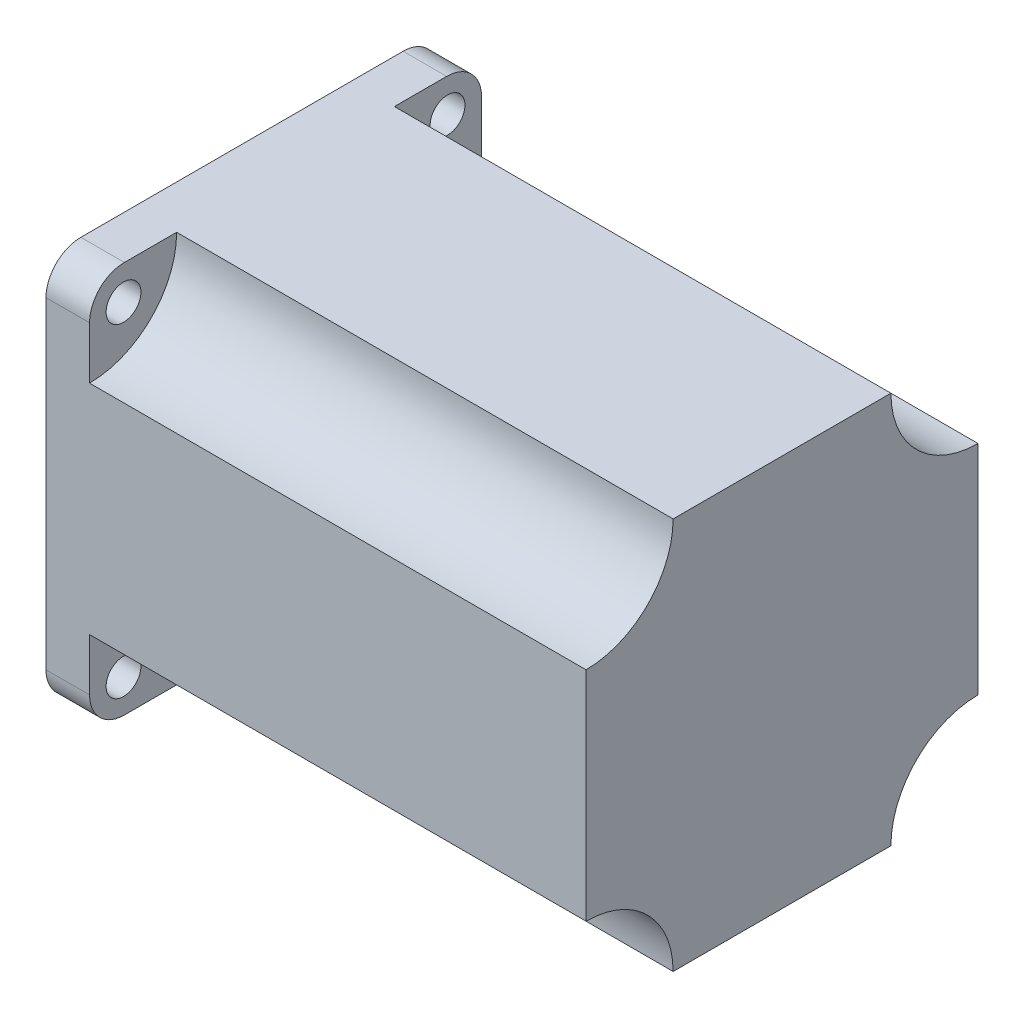
ISO-10303-21;
HEADER;
FILE_DESCRIPTION(('STEP AP214'),'2;1');
FILE_NAME('part.step','',(''),(''),'','','');
FILE_SCHEMA(('AUTOMOTIVE_DESIGN { 1 0 10303 214 1 1 1 1 }'));
ENDSEC;
DATA;
#1=APPLICATION_CONTEXT('core data for automotive mechanical design processes');
#2=APPLICATION_PROTOCOL_DEFINITION('international standard','automotive_design',2000,#1);
#3=PRODUCT_CONTEXT('',#1,'mechanical');
#4=PRODUCT('Part','Part','',(#3));
#5=PRODUCT_RELATED_PRODUCT_CATEGORY('part','',(#4));
#6=PRODUCT_DEFINITION_FORMATION('','',#4);
#7=PRODUCT_DEFINITION_CONTEXT('part definition',#1,'design');
#8=PRODUCT_DEFINITION('design','',#6,#7);
#9=PRODUCT_DEFINITION_SHAPE('','',#8);
#10=(LENGTH_UNIT() NAMED_UNIT(*) SI_UNIT(.MILLI.,.METRE.));
#11=(NAMED_UNIT(*) PLANE_ANGLE_UNIT() SI_UNIT($,.RADIAN.));
#12=(NAMED_UNIT(*) SI_UNIT($,.STERADIAN.) SOLID_ANGLE_UNIT());
#13=UNCERTAINTY_MEASURE_WITH_UNIT(LENGTH_MEASURE(1.E-05),#10,'distance_accuracy_value','');
#14=(GEOMETRIC_REPRESENTATION_CONTEXT(3) GLOBAL_UNCERTAINTY_ASSIGNED_CONTEXT((#13)) GLOBAL_UNIT_ASSIGNED_CONTEXT((#10,
#11,#12)) REPRESENTATION_CONTEXT('',''));
#15=CARTESIAN_POINT('',(0.,0.,0.));
#16=DIRECTION('',(0.,0.,1.));
#17=DIRECTION('',(1.,0.,0.));
#18=AXIS2_PLACEMENT_3D('',#15,#16,#17);
#19=CARTESIAN_POINT('',(6.35,0.,0.));
#20=DIRECTION('',(-1.,0.,0.));
#21=DIRECTION('',(0.,0.,1.));
#22=AXIS2_PLACEMENT_3D('',#19,#20,#21);
#23=PLANE('',#22);
#24=CARTESIAN_POINT('',(6.35,23.622,23.622));
#25=DIRECTION('',(1.,0.,0.));
#26=DIRECTION('',(0.,0.,-1.));
#27=AXIS2_PLACEMENT_3D('',#24,#25,#26);
#28=CIRCLE('',#27,2.54);
#29=CARTESIAN_POINT('',(6.35,23.622,21.082));
#30=VERTEX_POINT('',#29);
#31=EDGE_CURVE('E467',#30,#30,#28,.T.);
#32=ORIENTED_EDGE('',*,*,#31,.F.);
#33=EDGE_LOOP('',(#32));
#34=FACE_BOUND('',#33,.T.);
#35=DIRECTION('',(0.,-1.,0.));
#36=VECTOR('',#35,1.);
#37=CARTESIAN_POINT('',(6.35,28.575,28.575));
#38=LINE('',#37,#36);
#39=CARTESIAN_POINT('',(6.35,23.495,28.575));
#40=VERTEX_POINT('',#39);
#41=CARTESIAN_POINT('',(6.35,15.875,28.575));
#42=VERTEX_POINT('',#41);
#43=EDGE_CURVE('E290',#40,#42,#38,.T.);
#44=ORIENTED_EDGE('',*,*,#43,.T.);
#45=CARTESIAN_POINT('',(6.35,28.575,28.575));
#46=DIRECTION('',(1.,0.,0.));
#47=DIRECTION('',(0.,0.,-1.));
#48=AXIS2_PLACEMENT_3D('',#45,#46,#47);
#49=CIRCLE('',#48,12.7);
#50=CARTESIAN_POINT('',(6.35,28.575,15.875));
#51=VERTEX_POINT('',#50);
#52=EDGE_CURVE('E170',#42,#51,#49,.T.);
#53=ORIENTED_EDGE('',*,*,#52,.T.);
#54=DIRECTION('',(0.,0.,1.));
#55=VECTOR('',#54,1.);
#56=CARTESIAN_POINT('',(6.35,28.575,-28.575));
#57=LINE('',#56,#55);
#58=CARTESIAN_POINT('',(6.35,28.575,23.495));
#59=VERTEX_POINT('',#58);
#60=EDGE_CURVE('E65',#51,#59,#57,.T.);
#61=ORIENTED_EDGE('',*,*,#60,.T.);
#62=CARTESIAN_POINT('',(6.35,23.495,23.495));
#63=DIRECTION('',(-1.,0.,0.));
#64=DIRECTION('',(0.,0.,1.));
#65=AXIS2_PLACEMENT_3D('',#62,#63,#64);
#66=CIRCLE('',#65,5.08);
#67=EDGE_CURVE('E346',#59,#40,#66,.F.);
#68=ORIENTED_EDGE('',*,*,#67,.T.);
#69=EDGE_LOOP('',(#44,#53,#61,#68));
#70=FACE_BOUND('',#69,.T.);
#71=ADVANCED_FACE('F38',(#34,#70),#23,.F.);
#72=CARTESIAN_POINT('',(6.35,23.622,-23.622));
#73=DIRECTION('',(1.,0.,0.));
#74=DIRECTION('',(0.,0.,-1.));
#75=AXIS2_PLACEMENT_3D('',#72,#73,#74);
#76=CIRCLE('',#75,2.54);
#77=CARTESIAN_POINT('',(6.35,23.622,-26.162));
#78=VERTEX_POINT('',#77);
#79=EDGE_CURVE('E382',#78,#78,#76,.T.);
#80=ORIENTED_EDGE('',*,*,#79,.F.);
#81=EDGE_LOOP('',(#80));
#82=FACE_BOUND('',#81,.T.);
#83=CARTESIAN_POINT('',(6.35,28.575,-23.495));
#84=VERTEX_POINT('',#83);
#85=CARTESIAN_POINT('',(6.35,28.575,-15.875));
#86=VERTEX_POINT('',#85);
#87=EDGE_CURVE('E311',#84,#86,#57,.T.);
#88=ORIENTED_EDGE('',*,*,#87,.T.);
#89=CARTESIAN_POINT('',(6.35,28.575,-28.575));
#90=DIRECTION('',(1.,0.,0.));
#91=DIRECTION('',(0.,0.,-1.));
#92=AXIS2_PLACEMENT_3D('',#89,#90,#91);
#93=CIRCLE('',#92,12.7);
#94=CARTESIAN_POINT('',(6.35,15.875,-28.575));
#95=VERTEX_POINT('',#94);
#96=EDGE_CURVE('E222',#86,#95,#93,.T.);
#97=ORIENTED_EDGE('',*,*,#96,.T.);
#98=DIRECTION('',(0.,1.,0.));
#99=VECTOR('',#98,1.);
#100=CARTESIAN_POINT('',(6.35,28.575,-28.575));
#101=LINE('',#100,#99);
#102=CARTESIAN_POINT('',(6.35,23.495,-28.575));
#103=VERTEX_POINT('',#102);
#104=EDGE_CURVE('E294',#95,#103,#101,.T.);
#105=ORIENTED_EDGE('',*,*,#104,.T.);
#106=CARTESIAN_POINT('',(6.35,23.495,-23.495));
#107=DIRECTION('',(-1.,0.,0.));
#108=DIRECTION('',(0.,0.,1.));
#109=AXIS2_PLACEMENT_3D('',#106,#107,#108);
#110=CIRCLE('',#109,5.08);
#111=EDGE_CURVE('E349',#103,#84,#110,.F.);
#112=ORIENTED_EDGE('',*,*,#111,.T.);
#113=EDGE_LOOP('',(#88,#97,#105,#112));
#114=FACE_BOUND('',#113,.T.);
#115=ADVANCED_FACE('F419',(#82,#114),#23,.F.);
#116=CARTESIAN_POINT('',(6.35,-23.622,-23.622));
#117=DIRECTION('',(1.,0.,0.));
#118=DIRECTION('',(0.,0.,-1.));
#119=AXIS2_PLACEMENT_3D('',#116,#117,#118);
#120=CIRCLE('',#119,2.54);
#121=CARTESIAN_POINT('',(6.35,-23.622,-26.162));
#122=VERTEX_POINT('',#121);
#123=EDGE_CURVE('E448',#122,#122,#120,.T.);
#124=ORIENTED_EDGE('',*,*,#123,.F.);
#125=EDGE_LOOP('',(#124));
#126=FACE_BOUND('',#125,.T.);
#127=CARTESIAN_POINT('',(6.35,-23.495,-28.575));
#128=VERTEX_POINT('',#127);
#129=CARTESIAN_POINT('',(6.35,-15.875,-28.575));
#130=VERTEX_POINT('',#129);
#131=EDGE_CURVE('E283',#128,#130,#101,.T.);
#132=ORIENTED_EDGE('',*,*,#131,.T.);
#133=CARTESIAN_POINT('',(6.35,-28.575,-28.575));
#134=DIRECTION('',(1.,0.,0.));
#135=DIRECTION('',(0.,0.,-1.));
#136=AXIS2_PLACEMENT_3D('',#133,#134,#135);
#137=CIRCLE('',#136,12.7);
#138=CARTESIAN_POINT('',(6.35,-28.575,-15.875));
#139=VERTEX_POINT('',#138);
#140=EDGE_CURVE('E194',#130,#139,#137,.T.);
#141=ORIENTED_EDGE('',*,*,#140,.T.);
#142=DIRECTION('',(0.,0.,-1.));
#143=VECTOR('',#142,1.);
#144=CARTESIAN_POINT('',(6.35,-28.575,-28.575));
#145=LINE('',#144,#143);
#146=CARTESIAN_POINT('',(6.35,-28.575,-23.495));
#147=VERTEX_POINT('',#146);
#148=EDGE_CURVE('E280',#139,#147,#145,.T.);
#149=ORIENTED_EDGE('',*,*,#148,.T.);
#150=CARTESIAN_POINT('',(6.35,-23.495,-23.495));
#151=DIRECTION('',(-1.,0.,0.));
#152=DIRECTION('',(0.,0.,1.));
#153=AXIS2_PLACEMENT_3D('',#150,#151,#152);
#154=CIRCLE('',#153,5.08);
#155=EDGE_CURVE('E354',#147,#128,#154,.F.);
#156=ORIENTED_EDGE('',*,*,#155,.T.);
#157=EDGE_LOOP('',(#132,#141,#149,#156));
#158=FACE_BOUND('',#157,.T.);
#159=ADVANCED_FACE('F279',(#126,#158),#23,.F.);
#160=CARTESIAN_POINT('',(-1.524,0.,0.));
#161=DIRECTION('',(-1.,0.,0.));
#162=DIRECTION('',(0.,0.,1.));
#163=AXIS2_PLACEMENT_3D('',#160,#161,#162);
#164=PLANE('',#163);
#165=CARTESIAN_POINT('',(-1.524,0.,0.));
#166=DIRECTION('',(-1.,0.,0.));
#167=DIRECTION('',(0.,0.,1.));
#168=AXIS2_PLACEMENT_3D('',#165,#166,#167);
#169=CIRCLE('',#168,19.05);
#170=CARTESIAN_POINT('',(-1.524,0.,19.05));
#171=VERTEX_POINT('',#170);
#172=EDGE_CURVE('E457',#171,#171,#169,.T.);
#173=ORIENTED_EDGE('',*,*,#172,.T.);
#174=EDGE_LOOP('',(#173));
#175=FACE_BOUND('',#174,.T.);
#176=CARTESIAN_POINT('',(-1.524,0.,0.));
#177=DIRECTION('',(-1.,0.,0.));
#178=DIRECTION('',(0.,0.,1.));
#179=AXIS2_PLACEMENT_3D('',#176,#177,#178);
#180=CIRCLE('',#179,3.175);
#181=CARTESIAN_POINT('',(-1.524,0.,3.175));
#182=VERTEX_POINT('',#181);
#183=EDGE_CURVE('E262',#182,#182,#180,.T.);
#184=ORIENTED_EDGE('',*,*,#183,.F.);
#185=EDGE_LOOP('',(#184));
#186=FACE_BOUND('',#185,.T.);
#187=ADVANCED_FACE('F436',(#175,#186),#164,.T.);
#188=CARTESIAN_POINT('',(0.,0.,0.));
#189=DIRECTION('',(-1.,0.,0.));
#190=DIRECTION('',(0.,0.,1.));
#191=AXIS2_PLACEMENT_3D('',#188,#189,#190);
#192=PLANE('',#191);
#193=CARTESIAN_POINT('',(0.,-23.622,-23.622));
#194=DIRECTION('',(1.,0.,0.));
#195=DIRECTION('',(0.,0.,-1.));
#196=AXIS2_PLACEMENT_3D('',#193,#194,#195);
#197=CIRCLE('',#196,2.54);
#198=CARTESIAN_POINT('',(0.,-23.622,-26.162));
#199=VERTEX_POINT('',#198);
#200=EDGE_CURVE('E451',#199,#199,#197,.T.);
#201=ORIENTED_EDGE('',*,*,#200,.T.);
#202=EDGE_LOOP('',(#201));
#203=FACE_BOUND('',#202,.T.);
#204=CARTESIAN_POINT('',(0.,23.622,23.622));
#205=DIRECTION('',(1.,0.,0.));
#206=DIRECTION('',(0.,0.,-1.));
#207=AXIS2_PLACEMENT_3D('',#204,#205,#206);
#208=CIRCLE('',#207,2.54);
#209=CARTESIAN_POINT('',(0.,23.622,21.082));
#210=VERTEX_POINT('',#209);
#211=EDGE_CURVE('E465',#210,#210,#208,.T.);
#212=ORIENTED_EDGE('',*,*,#211,.T.);
#213=EDGE_LOOP('',(#212));
#214=FACE_BOUND('',#213,.T.);
#215=DIRECTION('',(0.,1.,0.));
#216=VECTOR('',#215,1.);
#217=CARTESIAN_POINT('',(0.,28.575,-28.575));
#218=LINE('',#217,#216);
#219=CARTESIAN_POINT('',(0.,-23.495,-28.575));
#220=VERTEX_POINT('',#219);
#221=CARTESIAN_POINT('',(0.,23.495,-28.575));
#222=VERTEX_POINT('',#221);
#223=EDGE_CURVE('E385',#220,#222,#218,.T.);
#224=ORIENTED_EDGE('',*,*,#223,.F.);
#225=CARTESIAN_POINT('',(0.,-23.495,-23.495));
#226=DIRECTION('',(-1.,0.,0.));
#227=DIRECTION('',(0.,0.,1.));
#228=AXIS2_PLACEMENT_3D('',#225,#226,#227);
#229=CIRCLE('',#228,5.08);
#230=CARTESIAN_POINT('',(0.,-28.575,-23.495));
#231=VERTEX_POINT('',#230);
#232=EDGE_CURVE('E339',#220,#231,#229,.T.);
#233=ORIENTED_EDGE('',*,*,#232,.T.);
#234=DIRECTION('',(0.,0.,-1.));
#235=VECTOR('',#234,1.);
#236=CARTESIAN_POINT('',(0.,-28.575,-28.575));
#237=LINE('',#236,#235);
#238=CARTESIAN_POINT('',(0.,-28.575,23.495));
#239=VERTEX_POINT('',#238);
#240=EDGE_CURVE('E381',#239,#231,#237,.T.);
#241=ORIENTED_EDGE('',*,*,#240,.F.);
#242=CARTESIAN_POINT('',(0.,-23.495,23.495));
#243=DIRECTION('',(-1.,0.,0.));
#244=DIRECTION('',(0.,0.,1.));
#245=AXIS2_PLACEMENT_3D('',#242,#243,#244);
#246=CIRCLE('',#245,5.08);
#247=CARTESIAN_POINT('',(0.,-23.495,28.575));
#248=VERTEX_POINT('',#247);
#249=EDGE_CURVE('E336',#239,#248,#246,.T.);
#250=ORIENTED_EDGE('',*,*,#249,.T.);
#251=DIRECTION('',(0.,-1.,0.));
#252=VECTOR('',#251,1.);
#253=CARTESIAN_POINT('',(0.,28.575,28.575));
#254=LINE('',#253,#252);
#255=CARTESIAN_POINT('',(0.,23.495,28.575));
#256=VERTEX_POINT('',#255);
#257=EDGE_CURVE('E373',#256,#248,#254,.T.);
#258=ORIENTED_EDGE('',*,*,#257,.F.);
#259=CARTESIAN_POINT('',(0.,23.495,23.495));
#260=DIRECTION('',(-1.,0.,0.));
#261=DIRECTION('',(0.,0.,1.));
#262=AXIS2_PLACEMENT_3D('',#259,#260,#261);
#263=CIRCLE('',#262,5.08);
#264=CARTESIAN_POINT('',(0.,28.575,23.495));
#265=VERTEX_POINT('',#264);
#266=EDGE_CURVE('E326',#256,#265,#263,.T.);
#267=ORIENTED_EDGE('',*,*,#266,.T.);
#268=DIRECTION('',(0.,0.,1.));
#269=VECTOR('',#268,1.);
#270=CARTESIAN_POINT('',(0.,28.575,-28.575));
#271=LINE('',#270,#269);
#272=CARTESIAN_POINT('',(0.,28.575,-23.495));
#273=VERTEX_POINT('',#272);
#274=EDGE_CURVE('E329',#273,#265,#271,.T.);
#275=ORIENTED_EDGE('',*,*,#274,.F.);
#276=CARTESIAN_POINT('',(0.,23.495,-23.495));
#277=DIRECTION('',(-1.,0.,0.));
#278=DIRECTION('',(0.,0.,1.));
#279=AXIS2_PLACEMENT_3D('',#276,#277,#278);
#280=CIRCLE('',#279,5.08);
#281=EDGE_CURVE('E334',#273,#222,#280,.T.);
#282=ORIENTED_EDGE('',*,*,#281,.T.);
#283=EDGE_LOOP('',(#224,#233,#241,#250,#258,#267,#275,#282));
#284=FACE_BOUND('',#283,.T.);
#285=CARTESIAN_POINT('',(0.,23.622,-23.622));
#286=DIRECTION('',(1.,0.,0.));
#287=DIRECTION('',(0.,0.,-1.));
#288=AXIS2_PLACEMENT_3D('',#285,#286,#287);
#289=CIRCLE('',#288,2.54);
#290=CARTESIAN_POINT('',(0.,23.622,-26.162));
#291=VERTEX_POINT('',#290);
#292=EDGE_CURVE('E388',#291,#291,#289,.T.);
#293=ORIENTED_EDGE('',*,*,#292,.T.);
#294=EDGE_LOOP('',(#293));
#295=FACE_BOUND('',#294,.T.);
#296=CARTESIAN_POINT('',(0.,-23.622,23.622));
#297=DIRECTION('',(1.,0.,0.));
#298=DIRECTION('',(0.,0.,-1.));
#299=AXIS2_PLACEMENT_3D('',#296,#297,#298);
#300=CIRCLE('',#299,2.54);
#301=CARTESIAN_POINT('',(0.,-23.622,21.082));
#302=VERTEX_POINT('',#301);
#303=EDGE_CURVE('E450',#302,#302,#300,.T.);
#304=ORIENTED_EDGE('',*,*,#303,.T.);
#305=EDGE_LOOP('',(#304));
#306=FACE_BOUND('',#305,.T.);
#307=CARTESIAN_POINT('',(0.,0.,0.));
#308=DIRECTION('',(-1.,0.,0.));
#309=DIRECTION('',(0.,0.,1.));
#310=AXIS2_PLACEMENT_3D('',#307,#308,#309);
#311=CIRCLE('',#310,19.05);
#312=CARTESIAN_POINT('',(0.,0.,19.05));
#313=VERTEX_POINT('',#312);
#314=EDGE_CURVE('E460',#313,#313,#311,.T.);
#315=ORIENTED_EDGE('',*,*,#314,.F.);
#316=EDGE_LOOP('',(#315));
#317=FACE_BOUND('',#316,.T.);
#318=ADVANCED_FACE('F377',(#203,#214,#284,#295,#306,#317),#192,.T.);
#319=CARTESIAN_POINT('',(6.35,-23.622,23.622));
#320=DIRECTION('',(1.,0.,0.));
#321=DIRECTION('',(0.,0.,-1.));
#322=AXIS2_PLACEMENT_3D('',#319,#320,#321);
#323=CIRCLE('',#322,2.54);
#324=CARTESIAN_POINT('',(6.35,-23.622,21.082));
#325=VERTEX_POINT('',#324);
#326=EDGE_CURVE('E454',#325,#325,#323,.T.);
#327=ORIENTED_EDGE('',*,*,#326,.F.);
#328=EDGE_LOOP('',(#327));
#329=FACE_BOUND('',#328,.T.);
#330=CARTESIAN_POINT('',(6.35,-28.575,23.495));
#331=VERTEX_POINT('',#330);
#332=CARTESIAN_POINT('',(6.35,-28.575,15.875));
#333=VERTEX_POINT('',#332);
#334=EDGE_CURVE('E289',#331,#333,#145,.T.);
#335=ORIENTED_EDGE('',*,*,#334,.T.);
#336=CARTESIAN_POINT('',(6.35,-28.575,28.575));
#337=DIRECTION('',(1.,0.,0.));
#338=DIRECTION('',(0.,0.,-1.));
#339=AXIS2_PLACEMENT_3D('',#336,#337,#338);
#340=CIRCLE('',#339,12.7);
#341=CARTESIAN_POINT('',(6.35,-15.875,28.575));
#342=VERTEX_POINT('',#341);
#343=EDGE_CURVE('E191',#333,#342,#340,.T.);
#344=ORIENTED_EDGE('',*,*,#343,.T.);
#345=CARTESIAN_POINT('',(6.35,-23.495,28.575));
#346=VERTEX_POINT('',#345);
#347=EDGE_CURVE('E257',#342,#346,#38,.T.);
#348=ORIENTED_EDGE('',*,*,#347,.T.);
#349=CARTESIAN_POINT('',(6.35,-23.495,23.495));
#350=DIRECTION('',(-1.,0.,0.));
#351=DIRECTION('',(0.,0.,1.));
#352=AXIS2_PLACEMENT_3D('',#349,#350,#351);
#353=CIRCLE('',#352,5.08);
#354=EDGE_CURVE('E351',#346,#331,#353,.F.);
#355=ORIENTED_EDGE('',*,*,#354,.T.);
#356=EDGE_LOOP('',(#335,#344,#348,#355));
#357=FACE_BOUND('',#356,.T.);
#358=ADVANCED_FACE('F393',(#329,#357),#23,.F.);
#359=CARTESIAN_POINT('',(6.35,28.575,28.575));
#360=DIRECTION('',(0.,0.,-1.));
#361=DIRECTION('',(0.,1.,0.));
#362=AXIS2_PLACEMENT_3D('',#359,#360,#361);
#363=PLANE('',#362);
#364=ORIENTED_EDGE('',*,*,#257,.T.);
#365=DIRECTION('',(-1.,0.,0.));
#366=VECTOR('',#365,1.);
#367=CARTESIAN_POINT('',(6.35,-23.495,28.575));
#368=LINE('',#367,#366);
#369=EDGE_CURVE('E360',#248,#346,#368,.F.);
#370=ORIENTED_EDGE('',*,*,#369,.T.);
#371=ORIENTED_EDGE('',*,*,#347,.F.);
#372=DIRECTION('',(-1.,0.,0.));
#373=VECTOR('',#372,1.);
#374=CARTESIAN_POINT('',(78.74,-15.875,28.575));
#375=LINE('',#374,#373);
#376=CARTESIAN_POINT('',(78.74,-15.875,28.575));
#377=VERTEX_POINT('',#376);
#378=EDGE_CURVE('E57',#377,#342,#375,.T.);
#379=ORIENTED_EDGE('',*,*,#378,.F.);
#380=DIRECTION('',(0.,1.,0.));
#381=VECTOR('',#380,1.);
#382=CARTESIAN_POINT('',(78.74,-15.875,28.575));
#383=LINE('',#382,#381);
#384=CARTESIAN_POINT('',(78.74,15.875,28.575));
#385=VERTEX_POINT('',#384);
#386=EDGE_CURVE('E183',#377,#385,#383,.T.);
#387=ORIENTED_EDGE('',*,*,#386,.T.);
#388=DIRECTION('',(-1.,0.,0.));
#389=VECTOR('',#388,1.);
#390=CARTESIAN_POINT('',(78.74,15.875,28.575));
#391=LINE('',#390,#389);
#392=EDGE_CURVE('E166',#385,#42,#391,.T.);
#393=ORIENTED_EDGE('',*,*,#392,.T.);
#394=ORIENTED_EDGE('',*,*,#43,.F.);
#395=DIRECTION('',(-1.,0.,0.));
#396=VECTOR('',#395,1.);
#397=CARTESIAN_POINT('',(6.35,23.495,28.575));
#398=LINE('',#397,#396);
#399=EDGE_CURVE('E356',#40,#256,#398,.T.);
#400=ORIENTED_EDGE('',*,*,#399,.T.);
#401=EDGE_LOOP('',(#364,#370,#371,#379,#387,#393,#394,#400));
#402=FACE_BOUND('',#401,.T.);
#403=ADVANCED_FACE('F189',(#402),#363,.F.);
#404=CARTESIAN_POINT('',(6.35,-28.575,-28.575));
#405=DIRECTION('',(0.,1.,0.));
#406=DIRECTION('',(0.,0.,1.));
#407=AXIS2_PLACEMENT_3D('',#404,#405,#406);
#408=PLANE('',#407);
#409=ORIENTED_EDGE('',*,*,#240,.T.);
#410=DIRECTION('',(-1.,0.,0.));
#411=VECTOR('',#410,1.);
#412=CARTESIAN_POINT('',(6.35,-28.575,-23.495));
#413=LINE('',#412,#411);
#414=EDGE_CURVE('E287',#231,#147,#413,.F.);
#415=ORIENTED_EDGE('',*,*,#414,.T.);
#416=ORIENTED_EDGE('',*,*,#148,.F.);
#417=DIRECTION('',(-1.,0.,0.));
#418=VECTOR('',#417,1.);
#419=CARTESIAN_POINT('',(78.74,-28.575,-15.875));
#420=LINE('',#419,#418);
#421=CARTESIAN_POINT('',(78.74,-28.575,-15.875));
#422=VERTEX_POINT('',#421);
#423=EDGE_CURVE('E244',#422,#139,#420,.T.);
#424=ORIENTED_EDGE('',*,*,#423,.F.);
#425=DIRECTION('',(0.,0.,1.));
#426=VECTOR('',#425,1.);
#427=CARTESIAN_POINT('',(78.74,-28.575,-15.875));
#428=LINE('',#427,#426);
#429=CARTESIAN_POINT('',(78.74,-28.575,15.875));
#430=VERTEX_POINT('',#429);
#431=EDGE_CURVE('E211',#422,#430,#428,.T.);
#432=ORIENTED_EDGE('',*,*,#431,.T.);
#433=DIRECTION('',(-1.,0.,0.));
#434=VECTOR('',#433,1.);
#435=CARTESIAN_POINT('',(78.74,-28.575,15.875));
#436=LINE('',#435,#434);
#437=EDGE_CURVE('E263',#430,#333,#436,.T.);
#438=ORIENTED_EDGE('',*,*,#437,.T.);
#439=ORIENTED_EDGE('',*,*,#334,.F.);
#440=DIRECTION('',(-1.,0.,0.));
#441=VECTOR('',#440,1.);
#442=CARTESIAN_POINT('',(6.35,-28.575,23.495));
#443=LINE('',#442,#441);
#444=EDGE_CURVE('E341',#331,#239,#443,.T.);
#445=ORIENTED_EDGE('',*,*,#444,.T.);
#446=EDGE_LOOP('',(#409,#415,#416,#424,#432,#438,#439,#445));
#447=FACE_BOUND('',#446,.T.);
#448=ADVANCED_FACE('F285',(#447),#408,.F.);
#449=CARTESIAN_POINT('',(6.35,28.575,-28.575));
#450=DIRECTION('',(0.,0.,1.));
#451=DIRECTION('',(0.,-1.,0.));
#452=AXIS2_PLACEMENT_3D('',#449,#450,#451);
#453=PLANE('',#452);
#454=ORIENTED_EDGE('',*,*,#131,.F.);
#455=DIRECTION('',(-1.,0.,0.));
#456=VECTOR('',#455,1.);
#457=CARTESIAN_POINT('',(6.35,-23.495,-28.575));
#458=LINE('',#457,#456);
#459=EDGE_CURVE('E318',#128,#220,#458,.T.);
#460=ORIENTED_EDGE('',*,*,#459,.T.);
#461=ORIENTED_EDGE('',*,*,#223,.T.);
#462=DIRECTION('',(-1.,0.,0.));
#463=VECTOR('',#462,1.);
#464=CARTESIAN_POINT('',(6.35,23.495,-28.575));
#465=LINE('',#464,#463);
#466=EDGE_CURVE('E314',#222,#103,#465,.F.);
#467=ORIENTED_EDGE('',*,*,#466,.T.);
#468=ORIENTED_EDGE('',*,*,#104,.F.);
#469=DIRECTION('',(-1.,0.,0.));
#470=VECTOR('',#469,1.);
#471=CARTESIAN_POINT('',(78.74,15.875,-28.575));
#472=LINE('',#471,#470);
#473=CARTESIAN_POINT('',(78.74,15.875,-28.575));
#474=VERTEX_POINT('',#473);
#475=EDGE_CURVE('E232',#474,#95,#472,.T.);
#476=ORIENTED_EDGE('',*,*,#475,.F.);
#477=DIRECTION('',(0.,-1.,0.));
#478=VECTOR('',#477,1.);
#479=CARTESIAN_POINT('',(78.74,15.875,-28.575));
#480=LINE('',#479,#478);
#481=CARTESIAN_POINT('',(78.74,-15.875,-28.575));
#482=VERTEX_POINT('',#481);
#483=EDGE_CURVE('E203',#474,#482,#480,.T.);
#484=ORIENTED_EDGE('',*,*,#483,.T.);
#485=DIRECTION('',(-1.,0.,0.));
#486=VECTOR('',#485,1.);
#487=CARTESIAN_POINT('',(78.74,-15.875,-28.575));
#488=LINE('',#487,#486);
#489=EDGE_CURVE('E239',#482,#130,#488,.T.);
#490=ORIENTED_EDGE('',*,*,#489,.T.);
#491=EDGE_LOOP('',(#454,#460,#461,#467,#468,#476,#484,#490));
#492=FACE_BOUND('',#491,.T.);
#493=ADVANCED_FACE('F402',(#492),#453,.F.);
#494=CARTESIAN_POINT('',(6.35,28.575,-28.575));
#495=DIRECTION('',(0.,-1.,0.));
#496=DIRECTION('',(0.,0.,-1.));
#497=AXIS2_PLACEMENT_3D('',#494,#495,#496);
#498=PLANE('',#497);
#499=ORIENTED_EDGE('',*,*,#87,.F.);
#500=DIRECTION('',(-1.,0.,0.));
#501=VECTOR('',#500,1.);
#502=CARTESIAN_POINT('',(6.35,28.575,-23.495));
#503=LINE('',#502,#501);
#504=EDGE_CURVE('E11',#84,#273,#503,.T.);
#505=ORIENTED_EDGE('',*,*,#504,.T.);
#506=ORIENTED_EDGE('',*,*,#274,.T.);
#507=DIRECTION('',(-1.,0.,0.));
#508=VECTOR('',#507,1.);
#509=CARTESIAN_POINT('',(6.35,28.575,23.495));
#510=LINE('',#509,#508);
#511=EDGE_CURVE('E47',#265,#59,#510,.F.);
#512=ORIENTED_EDGE('',*,*,#511,.T.);
#513=ORIENTED_EDGE('',*,*,#60,.F.);
#514=DIRECTION('',(-1.,0.,0.));
#515=VECTOR('',#514,1.);
#516=CARTESIAN_POINT('',(78.74,28.575,15.875));
#517=LINE('',#516,#515);
#518=CARTESIAN_POINT('',(78.74,28.575,15.875));
#519=VERTEX_POINT('',#518);
#520=EDGE_CURVE('E176',#519,#51,#517,.T.);
#521=ORIENTED_EDGE('',*,*,#520,.F.);
#522=DIRECTION('',(0.,0.,-1.));
#523=VECTOR('',#522,1.);
#524=CARTESIAN_POINT('',(78.74,28.575,15.875));
#525=LINE('',#524,#523);
#526=CARTESIAN_POINT('',(78.74,28.575,-15.875));
#527=VERTEX_POINT('',#526);
#528=EDGE_CURVE('E186',#519,#527,#525,.T.);
#529=ORIENTED_EDGE('',*,*,#528,.T.);
#530=DIRECTION('',(-1.,0.,0.));
#531=VECTOR('',#530,1.);
#532=CARTESIAN_POINT('',(78.74,28.575,-15.875));
#533=LINE('',#532,#531);
#534=EDGE_CURVE('E227',#527,#86,#533,.T.);
#535=ORIENTED_EDGE('',*,*,#534,.T.);
#536=EDGE_LOOP('',(#499,#505,#506,#512,#513,#521,#529,#535));
#537=FACE_BOUND('',#536,.T.);
#538=ADVANCED_FACE('F368',(#537),#498,.F.);
#539=CARTESIAN_POINT('',(6.35,23.622,-23.622));
#540=DIRECTION('',(-1.,0.,0.));
#541=DIRECTION('',(0.,0.,1.));
#542=AXIS2_PLACEMENT_3D('',#539,#540,#541);
#543=CYLINDRICAL_SURFACE('',#542,2.54);
#544=ORIENTED_EDGE('',*,*,#79,.T.);
#545=EDGE_LOOP('',(#544));
#546=FACE_BOUND('',#545,.T.);
#547=ORIENTED_EDGE('',*,*,#292,.F.);
#548=EDGE_LOOP('',(#547));
#549=FACE_BOUND('',#548,.T.);
#550=ADVANCED_FACE('F475',(#546,#549),#543,.F.);
#551=CARTESIAN_POINT('',(6.35,23.622,23.622));
#552=DIRECTION('',(-1.,0.,0.));
#553=DIRECTION('',(0.,0.,1.));
#554=AXIS2_PLACEMENT_3D('',#551,#552,#553);
#555=CYLINDRICAL_SURFACE('',#554,2.54);
#556=ORIENTED_EDGE('',*,*,#31,.T.);
#557=EDGE_LOOP('',(#556));
#558=FACE_BOUND('',#557,.T.);
#559=ORIENTED_EDGE('',*,*,#211,.F.);
#560=EDGE_LOOP('',(#559));
#561=FACE_BOUND('',#560,.T.);
#562=ADVANCED_FACE('F477',(#558,#561),#555,.F.);
#563=CARTESIAN_POINT('',(6.35,-23.622,23.622));
#564=DIRECTION('',(-1.,0.,0.));
#565=DIRECTION('',(0.,0.,1.));
#566=AXIS2_PLACEMENT_3D('',#563,#564,#565);
#567=CYLINDRICAL_SURFACE('',#566,2.54);
#568=ORIENTED_EDGE('',*,*,#326,.T.);
#569=EDGE_LOOP('',(#568));
#570=FACE_BOUND('',#569,.T.);
#571=ORIENTED_EDGE('',*,*,#303,.F.);
#572=EDGE_LOOP('',(#571));
#573=FACE_BOUND('',#572,.T.);
#574=ADVANCED_FACE('F483',(#570,#573),#567,.F.);
#575=CARTESIAN_POINT('',(6.35,-23.622,-23.622));
#576=DIRECTION('',(-1.,0.,0.));
#577=DIRECTION('',(0.,0.,1.));
#578=AXIS2_PLACEMENT_3D('',#575,#576,#577);
#579=CYLINDRICAL_SURFACE('',#578,2.54);
#580=ORIENTED_EDGE('',*,*,#123,.T.);
#581=EDGE_LOOP('',(#580));
#582=FACE_BOUND('',#581,.T.);
#583=ORIENTED_EDGE('',*,*,#200,.F.);
#584=EDGE_LOOP('',(#583));
#585=FACE_BOUND('',#584,.T.);
#586=ADVANCED_FACE('F490',(#582,#585),#579,.F.);
#587=CARTESIAN_POINT('',(6.35,-23.495,-23.495));
#588=DIRECTION('',(-1.,0.,0.));
#589=DIRECTION('',(0.,0.,1.));
#590=AXIS2_PLACEMENT_3D('',#587,#588,#589);
#591=CYLINDRICAL_SURFACE('',#590,5.08);
#592=ORIENTED_EDGE('',*,*,#155,.F.);
#593=ORIENTED_EDGE('',*,*,#414,.F.);
#594=ORIENTED_EDGE('',*,*,#232,.F.);
#595=ORIENTED_EDGE('',*,*,#459,.F.);
#596=EDGE_LOOP('',(#592,#593,#594,#595));
#597=FACE_BOUND('',#596,.T.);
#598=ADVANCED_FACE('F401',(#597),#591,.T.);
#599=CARTESIAN_POINT('',(6.35,-23.495,23.495));
#600=DIRECTION('',(-1.,0.,0.));
#601=DIRECTION('',(0.,0.,1.));
#602=AXIS2_PLACEMENT_3D('',#599,#600,#601);
#603=CYLINDRICAL_SURFACE('',#602,5.08);
#604=ORIENTED_EDGE('',*,*,#354,.F.);
#605=ORIENTED_EDGE('',*,*,#369,.F.);
#606=ORIENTED_EDGE('',*,*,#249,.F.);
#607=ORIENTED_EDGE('',*,*,#444,.F.);
#608=EDGE_LOOP('',(#604,#605,#606,#607));
#609=FACE_BOUND('',#608,.T.);
#610=ADVANCED_FACE('F398',(#609),#603,.T.);
#611=CARTESIAN_POINT('',(6.35,23.495,-23.495));
#612=DIRECTION('',(-1.,0.,0.));
#613=DIRECTION('',(0.,0.,1.));
#614=AXIS2_PLACEMENT_3D('',#611,#612,#613);
#615=CYLINDRICAL_SURFACE('',#614,5.08);
#616=ORIENTED_EDGE('',*,*,#111,.F.);
#617=ORIENTED_EDGE('',*,*,#466,.F.);
#618=ORIENTED_EDGE('',*,*,#281,.F.);
#619=ORIENTED_EDGE('',*,*,#504,.F.);
#620=EDGE_LOOP('',(#616,#617,#618,#619));
#621=FACE_BOUND('',#620,.T.);
#622=ADVANCED_FACE('F510',(#621),#615,.T.);
#623=CARTESIAN_POINT('',(6.35,23.495,23.495));
#624=DIRECTION('',(-1.,0.,0.));
#625=DIRECTION('',(0.,0.,1.));
#626=AXIS2_PLACEMENT_3D('',#623,#624,#625);
#627=CYLINDRICAL_SURFACE('',#626,5.08);
#628=ORIENTED_EDGE('',*,*,#67,.F.);
#629=ORIENTED_EDGE('',*,*,#511,.F.);
#630=ORIENTED_EDGE('',*,*,#266,.F.);
#631=ORIENTED_EDGE('',*,*,#399,.F.);
#632=EDGE_LOOP('',(#628,#629,#630,#631));
#633=FACE_BOUND('',#632,.T.);
#634=ADVANCED_FACE('F40',(#633),#627,.T.);
#635=CARTESIAN_POINT('',(-1.524,0.,0.));
#636=DIRECTION('',(1.,0.,0.));
#637=DIRECTION('',(0.,0.,-1.));
#638=AXIS2_PLACEMENT_3D('',#635,#636,#637);
#639=CYLINDRICAL_SURFACE('',#638,19.05);
#640=ORIENTED_EDGE('',*,*,#172,.F.);
#641=EDGE_LOOP('',(#640));
#642=FACE_BOUND('',#641,.T.);
#643=ORIENTED_EDGE('',*,*,#314,.T.);
#644=EDGE_LOOP('',(#643));
#645=FACE_BOUND('',#644,.T.);
#646=ADVANCED_FACE('F494',(#642,#645),#639,.T.);
#647=CARTESIAN_POINT('',(-20.574,0.,0.));
#648=DIRECTION('',(1.,0.,0.));
#649=DIRECTION('',(0.,0.,-1.));
#650=AXIS2_PLACEMENT_3D('',#647,#648,#649);
#651=CYLINDRICAL_SURFACE('',#650,3.175);
#652=CARTESIAN_POINT('',(-20.574,0.,0.));
#653=DIRECTION('',(-1.,0.,0.));
#654=DIRECTION('',(0.,0.,1.));
#655=AXIS2_PLACEMENT_3D('',#652,#653,#654);
#656=CIRCLE('',#655,3.175);
#657=CARTESIAN_POINT('',(-20.574,0.,3.175));
#658=VERTEX_POINT('',#657);
#659=EDGE_CURVE('E253',#658,#658,#656,.T.);
#660=ORIENTED_EDGE('',*,*,#659,.F.);
#661=EDGE_LOOP('',(#660));
#662=FACE_BOUND('',#661,.T.);
#663=ORIENTED_EDGE('',*,*,#183,.T.);
#664=EDGE_LOOP('',(#663));
#665=FACE_BOUND('',#664,.T.);
#666=ADVANCED_FACE('F414',(#662,#665),#651,.T.);
#667=CARTESIAN_POINT('',(-20.574,0.,0.));
#668=DIRECTION('',(-1.,0.,0.));
#669=DIRECTION('',(0.,0.,1.));
#670=AXIS2_PLACEMENT_3D('',#667,#668,#669);
#671=PLANE('',#670);
#672=ORIENTED_EDGE('',*,*,#659,.T.);
#673=EDGE_LOOP('',(#672));
#674=FACE_BOUND('',#673,.T.);
#675=ADVANCED_FACE('F406',(#674),#671,.T.);
#676=CARTESIAN_POINT('',(78.74,-28.575,28.575));
#677=DIRECTION('',(-1.,0.,0.));
#678=DIRECTION('',(0.,0.,1.));
#679=AXIS2_PLACEMENT_3D('',#676,#677,#678);
#680=CYLINDRICAL_SURFACE('',#679,12.7);
#681=ORIENTED_EDGE('',*,*,#343,.F.);
#682=ORIENTED_EDGE('',*,*,#437,.F.);
#683=CARTESIAN_POINT('',(78.74,-28.575,28.575));
#684=DIRECTION('',(1.,0.,0.));
#685=DIRECTION('',(0.,0.,-1.));
#686=AXIS2_PLACEMENT_3D('',#683,#684,#685);
#687=CIRCLE('',#686,12.7);
#688=EDGE_CURVE('E177',#430,#377,#687,.T.);
#689=ORIENTED_EDGE('',*,*,#688,.T.);
#690=ORIENTED_EDGE('',*,*,#378,.T.);
#691=EDGE_LOOP('',(#681,#682,#689,#690));
#692=FACE_BOUND('',#691,.T.);
#693=ADVANCED_FACE('F404',(#692),#680,.F.);
#694=CARTESIAN_POINT('',(78.74,-28.575,-28.575));
#695=DIRECTION('',(-1.,0.,0.));
#696=DIRECTION('',(0.,0.,1.));
#697=AXIS2_PLACEMENT_3D('',#694,#695,#696);
#698=CYLINDRICAL_SURFACE('',#697,12.7);
#699=ORIENTED_EDGE('',*,*,#140,.F.);
#700=ORIENTED_EDGE('',*,*,#489,.F.);
#701=CARTESIAN_POINT('',(78.74,-28.575,-28.575));
#702=DIRECTION('',(1.,0.,0.));
#703=DIRECTION('',(0.,0.,-1.));
#704=AXIS2_PLACEMENT_3D('',#701,#702,#703);
#705=CIRCLE('',#704,12.7);
#706=EDGE_CURVE('E207',#482,#422,#705,.T.);
#707=ORIENTED_EDGE('',*,*,#706,.T.);
#708=ORIENTED_EDGE('',*,*,#423,.T.);
#709=EDGE_LOOP('',(#699,#700,#707,#708));
#710=FACE_BOUND('',#709,.T.);
#711=ADVANCED_FACE('F272',(#710),#698,.F.);
#712=CARTESIAN_POINT('',(78.74,28.575,-28.575));
#713=DIRECTION('',(-1.,0.,0.));
#714=DIRECTION('',(0.,0.,1.));
#715=AXIS2_PLACEMENT_3D('',#712,#713,#714);
#716=CYLINDRICAL_SURFACE('',#715,12.7);
#717=ORIENTED_EDGE('',*,*,#96,.F.);
#718=ORIENTED_EDGE('',*,*,#534,.F.);
#719=CARTESIAN_POINT('',(78.74,28.575,-28.575));
#720=DIRECTION('',(1.,0.,0.));
#721=DIRECTION('',(0.,0.,-1.));
#722=AXIS2_PLACEMENT_3D('',#719,#720,#721);
#723=CIRCLE('',#722,12.7);
#724=EDGE_CURVE('E199',#527,#474,#723,.T.);
#725=ORIENTED_EDGE('',*,*,#724,.T.);
#726=ORIENTED_EDGE('',*,*,#475,.T.);
#727=EDGE_LOOP('',(#717,#718,#725,#726));
#728=FACE_BOUND('',#727,.T.);
#729=ADVANCED_FACE('F412',(#728),#716,.F.);
#730=CARTESIAN_POINT('',(78.74,28.575,28.575));
#731=DIRECTION('',(-1.,0.,0.));
#732=DIRECTION('',(0.,0.,1.));
#733=AXIS2_PLACEMENT_3D('',#730,#731,#732);
#734=CYLINDRICAL_SURFACE('',#733,12.7);
#735=ORIENTED_EDGE('',*,*,#52,.F.);
#736=ORIENTED_EDGE('',*,*,#392,.F.);
#737=CARTESIAN_POINT('',(78.74,28.575,28.575));
#738=DIRECTION('',(1.,0.,0.));
#739=DIRECTION('',(0.,0.,-1.));
#740=AXIS2_PLACEMENT_3D('',#737,#738,#739);
#741=CIRCLE('',#740,12.7);
#742=EDGE_CURVE('E169',#385,#519,#741,.T.);
#743=ORIENTED_EDGE('',*,*,#742,.T.);
#744=ORIENTED_EDGE('',*,*,#520,.T.);
#745=EDGE_LOOP('',(#735,#736,#743,#744));
#746=FACE_BOUND('',#745,.T.);
#747=ADVANCED_FACE('F168',(#746),#734,.F.);
#748=CARTESIAN_POINT('',(78.74,28.575,28.575));
#749=DIRECTION('',(1.,0.,0.));
#750=DIRECTION('',(0.,0.,-1.));
#751=AXIS2_PLACEMENT_3D('',#748,#749,#750);
#752=PLANE('',#751);
#753=ORIENTED_EDGE('',*,*,#386,.F.);
#754=ORIENTED_EDGE('',*,*,#688,.F.);
#755=ORIENTED_EDGE('',*,*,#431,.F.);
#756=ORIENTED_EDGE('',*,*,#706,.F.);
#757=ORIENTED_EDGE('',*,*,#483,.F.);
#758=ORIENTED_EDGE('',*,*,#724,.F.);
#759=ORIENTED_EDGE('',*,*,#528,.F.);
#760=ORIENTED_EDGE('',*,*,#742,.F.);
#761=EDGE_LOOP('',(#753,#754,#755,#756,#757,#758,#759,#760));
#762=FACE_BOUND('',#761,.T.);
#763=ADVANCED_FACE('F181',(#762),#752,.T.);
#764=CLOSED_SHELL('',(#71,#115,#159,#187,#318,#358,#403,#448,#493,#538,#550,#562,#574,#586,#598,
#610,#622,#634,#646,#666,#675,#693,#711,#729,#747,#763));
#765=MANIFOLD_SOLID_BREP('B2',#764);
#766=ADVANCED_BREP_SHAPE_REPRESENTATION('',(#18,#765),#14);
#767=SHAPE_DEFINITION_REPRESENTATION(#9,#766);
ENDSEC;
END-ISO-10303-21;
